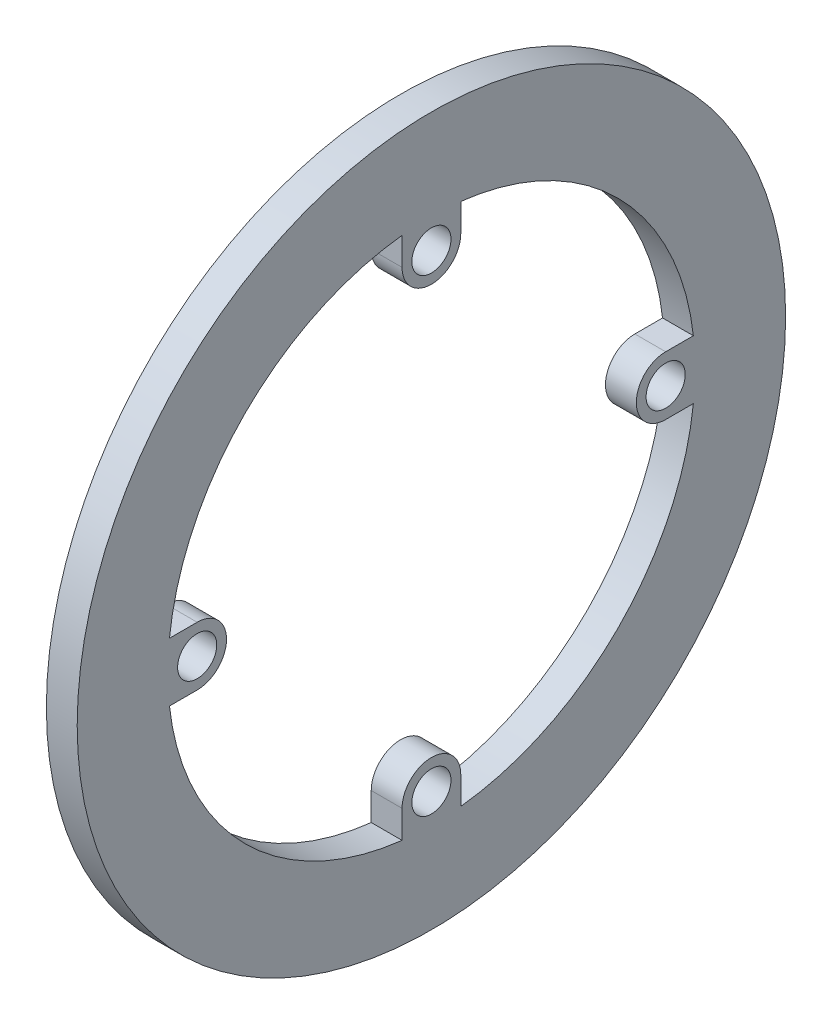
ISO-10303-21;
HEADER;
FILE_DESCRIPTION(('STEP AP214'),'2;1');
FILE_NAME('part.step','',(''),(''),'','','');
FILE_SCHEMA(('AUTOMOTIVE_DESIGN { 1 0 10303 214 1 1 1 1 }'));
ENDSEC;
DATA;
#1=APPLICATION_CONTEXT('core data for automotive mechanical design processes');
#2=APPLICATION_PROTOCOL_DEFINITION('international standard','automotive_design',2000,#1);
#3=PRODUCT_CONTEXT('',#1,'mechanical');
#4=PRODUCT('Part','Part','',(#3));
#5=PRODUCT_RELATED_PRODUCT_CATEGORY('part','',(#4));
#6=PRODUCT_DEFINITION_FORMATION('','',#4);
#7=PRODUCT_DEFINITION_CONTEXT('part definition',#1,'design');
#8=PRODUCT_DEFINITION('design','',#6,#7);
#9=PRODUCT_DEFINITION_SHAPE('','',#8);
#10=(LENGTH_UNIT() NAMED_UNIT(*) SI_UNIT(.MILLI.,.METRE.));
#11=(NAMED_UNIT(*) PLANE_ANGLE_UNIT() SI_UNIT($,.RADIAN.));
#12=(NAMED_UNIT(*) SI_UNIT($,.STERADIAN.) SOLID_ANGLE_UNIT());
#13=UNCERTAINTY_MEASURE_WITH_UNIT(LENGTH_MEASURE(1.E-05),#10,'distance_accuracy_value','');
#14=(GEOMETRIC_REPRESENTATION_CONTEXT(3) GLOBAL_UNCERTAINTY_ASSIGNED_CONTEXT((#13)) GLOBAL_UNIT_ASSIGNED_CONTEXT((#10,
#11,#12)) REPRESENTATION_CONTEXT('',''));
#15=CARTESIAN_POINT('',(0.,0.,0.));
#16=DIRECTION('',(0.,0.,1.));
#17=DIRECTION('',(1.,0.,0.));
#18=AXIS2_PLACEMENT_3D('',#15,#16,#17);
#19=CARTESIAN_POINT('',(2.5,0.,0.));
#20=DIRECTION('',(-1.,0.,0.));
#21=DIRECTION('',(0.,0.,1.));
#22=AXIS2_PLACEMENT_3D('',#19,#20,#21);
#23=CYLINDRICAL_SURFACE('',#22,42.7625);
#24=CARTESIAN_POINT('',(-2.5,0.,0.));
#25=DIRECTION('',(1.,0.,0.));
#26=DIRECTION('',(0.,0.,-1.));
#27=AXIS2_PLACEMENT_3D('',#24,#25,#26);
#28=CIRCLE('',#27,42.7625);
#29=CARTESIAN_POINT('',(-2.5,4.7625,-42.4964704416732));
#30=VERTEX_POINT('',#29);
#31=CARTESIAN_POINT('',(-2.5,42.4964704416732,-4.7625));
#32=VERTEX_POINT('',#31);
#33=EDGE_CURVE('E194',#30,#32,#28,.T.);
#34=ORIENTED_EDGE('',*,*,#33,.F.);
#35=DIRECTION('',(-1.,0.,0.));
#36=VECTOR('',#35,1.);
#37=CARTESIAN_POINT('',(2.5,4.7625,-42.4964704416732));
#38=LINE('',#37,#36);
#39=CARTESIAN_POINT('',(2.5,4.7625,-42.4964704416732));
#40=VERTEX_POINT('',#39);
#41=EDGE_CURVE('E11',#40,#30,#38,.T.);
#42=ORIENTED_EDGE('',*,*,#41,.F.);
#43=CARTESIAN_POINT('',(2.5,0.,0.));
#44=DIRECTION('',(1.,0.,0.));
#45=DIRECTION('',(0.,0.,-1.));
#46=AXIS2_PLACEMENT_3D('',#43,#44,#45);
#47=CIRCLE('',#46,42.7625);
#48=CARTESIAN_POINT('',(2.5,42.4964704416732,-4.7625));
#49=VERTEX_POINT('',#48);
#50=EDGE_CURVE('E246',#40,#49,#47,.T.);
#51=ORIENTED_EDGE('',*,*,#50,.T.);
#52=DIRECTION('',(-1.,0.,0.));
#53=VECTOR('',#52,1.);
#54=CARTESIAN_POINT('',(2.5,42.4964704416732,-4.7625));
#55=LINE('',#54,#53);
#56=EDGE_CURVE('E52',#49,#32,#55,.T.);
#57=ORIENTED_EDGE('',*,*,#56,.T.);
#58=EDGE_LOOP('',(#34,#42,#51,#57));
#59=FACE_BOUND('',#58,.T.);
#60=ADVANCED_FACE('F35',(#59),#23,.F.);
#61=CARTESIAN_POINT('',(2.5,4.7625,0.));
#62=DIRECTION('',(0.,-1.,0.));
#63=DIRECTION('',(0.,0.,-1.));
#64=AXIS2_PLACEMENT_3D('',#61,#62,#63);
#65=PLANE('',#64);
#66=DIRECTION('',(0.,0.,1.));
#67=VECTOR('',#66,1.);
#68=CARTESIAN_POINT('',(-2.5,4.7625,0.));
#69=LINE('',#68,#67);
#70=CARTESIAN_POINT('',(-2.5,4.7625,-38.));
#71=VERTEX_POINT('',#70);
#72=EDGE_CURVE('E196',#30,#71,#69,.T.);
#73=ORIENTED_EDGE('',*,*,#72,.T.);
#74=DIRECTION('',(-1.,0.,0.));
#75=VECTOR('',#74,1.);
#76=CARTESIAN_POINT('',(2.5,4.7625,-38.));
#77=LINE('',#76,#75);
#78=CARTESIAN_POINT('',(2.5,4.7625,-38.));
#79=VERTEX_POINT('',#78);
#80=EDGE_CURVE('E44',#79,#71,#77,.T.);
#81=ORIENTED_EDGE('',*,*,#80,.F.);
#82=DIRECTION('',(0.,0.,1.));
#83=VECTOR('',#82,1.);
#84=CARTESIAN_POINT('',(2.5,4.7625,0.));
#85=LINE('',#84,#83);
#86=EDGE_CURVE('E298',#40,#79,#85,.T.);
#87=ORIENTED_EDGE('',*,*,#86,.F.);
#88=ORIENTED_EDGE('',*,*,#41,.T.);
#89=EDGE_LOOP('',(#73,#81,#87,#88));
#90=FACE_BOUND('',#89,.T.);
#91=ADVANCED_FACE('F37',(#90),#65,.F.);
#92=CARTESIAN_POINT('',(2.5,0.,-38.));
#93=DIRECTION('',(-1.,0.,0.));
#94=DIRECTION('',(0.,0.,1.));
#95=AXIS2_PLACEMENT_3D('',#92,#93,#94);
#96=CYLINDRICAL_SURFACE('',#95,4.7625);
#97=CARTESIAN_POINT('',(-2.5,0.,-38.));
#98=DIRECTION('',(1.,0.,0.));
#99=DIRECTION('',(0.,0.,-1.));
#100=AXIS2_PLACEMENT_3D('',#97,#98,#99);
#101=CIRCLE('',#100,4.7625);
#102=CARTESIAN_POINT('',(-2.5,-4.76250000000001,-38.));
#103=VERTEX_POINT('',#102);
#104=EDGE_CURVE('E200',#71,#103,#101,.T.);
#105=ORIENTED_EDGE('',*,*,#104,.T.);
#106=DIRECTION('',(-1.,0.,0.));
#107=VECTOR('',#106,1.);
#108=CARTESIAN_POINT('',(2.5,-4.76250000000001,-38.));
#109=LINE('',#108,#107);
#110=CARTESIAN_POINT('',(2.5,-4.76250000000001,-38.));
#111=VERTEX_POINT('',#110);
#112=EDGE_CURVE('E268',#111,#103,#109,.T.);
#113=ORIENTED_EDGE('',*,*,#112,.F.);
#114=CARTESIAN_POINT('',(2.5,0.,-38.));
#115=DIRECTION('',(1.,0.,0.));
#116=DIRECTION('',(0.,0.,-1.));
#117=AXIS2_PLACEMENT_3D('',#114,#115,#116);
#118=CIRCLE('',#117,4.7625);
#119=EDGE_CURVE('E276',#79,#111,#118,.T.);
#120=ORIENTED_EDGE('',*,*,#119,.F.);
#121=ORIENTED_EDGE('',*,*,#80,.T.);
#122=EDGE_LOOP('',(#105,#113,#120,#121));
#123=FACE_BOUND('',#122,.T.);
#124=ADVANCED_FACE('F274',(#123),#96,.T.);
#125=CARTESIAN_POINT('',(2.5,-4.76250000000001,0.));
#126=DIRECTION('',(0.,-1.,0.));
#127=DIRECTION('',(0.,0.,-1.));
#128=AXIS2_PLACEMENT_3D('',#125,#126,#127);
#129=PLANE('',#128);
#130=DIRECTION('',(0.,0.,1.));
#131=VECTOR('',#130,1.);
#132=CARTESIAN_POINT('',(-2.5,-4.76250000000001,0.));
#133=LINE('',#132,#131);
#134=CARTESIAN_POINT('',(-2.5,-4.76250000000001,-42.4964704416732));
#135=VERTEX_POINT('',#134);
#136=EDGE_CURVE('E203',#135,#103,#133,.T.);
#137=ORIENTED_EDGE('',*,*,#136,.F.);
#138=DIRECTION('',(-1.,0.,0.));
#139=VECTOR('',#138,1.);
#140=CARTESIAN_POINT('',(2.5,-4.76250000000001,-42.4964704416732));
#141=LINE('',#140,#139);
#142=CARTESIAN_POINT('',(2.5,-4.76250000000001,-42.4964704416732));
#143=VERTEX_POINT('',#142);
#144=EDGE_CURVE('E266',#143,#135,#141,.T.);
#145=ORIENTED_EDGE('',*,*,#144,.F.);
#146=DIRECTION('',(0.,0.,1.));
#147=VECTOR('',#146,1.);
#148=CARTESIAN_POINT('',(2.5,-4.76250000000001,0.));
#149=LINE('',#148,#147);
#150=EDGE_CURVE('E290',#143,#111,#149,.T.);
#151=ORIENTED_EDGE('',*,*,#150,.T.);
#152=ORIENTED_EDGE('',*,*,#112,.T.);
#153=EDGE_LOOP('',(#137,#145,#151,#152));
#154=FACE_BOUND('',#153,.T.);
#155=ADVANCED_FACE('F287',(#154),#129,.T.);
#156=CARTESIAN_POINT('',(-2.5,-42.4964704416732,-4.7625));
#157=VERTEX_POINT('',#156);
#158=EDGE_CURVE('E198',#157,#135,#28,.T.);
#159=ORIENTED_EDGE('',*,*,#158,.F.);
#160=DIRECTION('',(-1.,0.,0.));
#161=VECTOR('',#160,1.);
#162=CARTESIAN_POINT('',(2.5,-42.4964704416732,-4.7625));
#163=LINE('',#162,#161);
#164=CARTESIAN_POINT('',(2.5,-42.4964704416732,-4.7625));
#165=VERTEX_POINT('',#164);
#166=EDGE_CURVE('E264',#165,#157,#163,.T.);
#167=ORIENTED_EDGE('',*,*,#166,.F.);
#168=EDGE_CURVE('E293',#165,#143,#47,.T.);
#169=ORIENTED_EDGE('',*,*,#168,.T.);
#170=ORIENTED_EDGE('',*,*,#144,.T.);
#171=EDGE_LOOP('',(#159,#167,#169,#170));
#172=FACE_BOUND('',#171,.T.);
#173=ADVANCED_FACE('F324',(#172),#23,.F.);
#174=CARTESIAN_POINT('',(2.5,0.,-4.7625));
#175=DIRECTION('',(0.,0.,1.));
#176=DIRECTION('',(1.,0.,0.));
#177=AXIS2_PLACEMENT_3D('',#174,#175,#176);
#178=PLANE('',#177);
#179=DIRECTION('',(0.,1.,0.));
#180=VECTOR('',#179,1.);
#181=CARTESIAN_POINT('',(-2.5,0.,-4.7625));
#182=LINE('',#181,#180);
#183=CARTESIAN_POINT('',(-2.5,-38.,-4.7625));
#184=VERTEX_POINT('',#183);
#185=EDGE_CURVE('E206',#157,#184,#182,.T.);
#186=ORIENTED_EDGE('',*,*,#185,.T.);
#187=DIRECTION('',(-1.,0.,0.));
#188=VECTOR('',#187,1.);
#189=CARTESIAN_POINT('',(2.5,-38.,-4.7625));
#190=LINE('',#189,#188);
#191=CARTESIAN_POINT('',(2.5,-38.,-4.7625));
#192=VERTEX_POINT('',#191);
#193=EDGE_CURVE('E262',#192,#184,#190,.T.);
#194=ORIENTED_EDGE('',*,*,#193,.F.);
#195=DIRECTION('',(0.,1.,0.));
#196=VECTOR('',#195,1.);
#197=CARTESIAN_POINT('',(2.5,0.,-4.7625));
#198=LINE('',#197,#196);
#199=EDGE_CURVE('E295',#165,#192,#198,.T.);
#200=ORIENTED_EDGE('',*,*,#199,.F.);
#201=ORIENTED_EDGE('',*,*,#166,.T.);
#202=EDGE_LOOP('',(#186,#194,#200,#201));
#203=FACE_BOUND('',#202,.T.);
#204=ADVANCED_FACE('F331',(#203),#178,.F.);
#205=CARTESIAN_POINT('',(2.5,-38.,0.));
#206=DIRECTION('',(-1.,0.,0.));
#207=DIRECTION('',(0.,0.,1.));
#208=AXIS2_PLACEMENT_3D('',#205,#206,#207);
#209=CYLINDRICAL_SURFACE('',#208,4.76249999999999);
#210=CARTESIAN_POINT('',(-2.5,-38.,0.));
#211=DIRECTION('',(1.,0.,0.));
#212=DIRECTION('',(0.,0.,-1.));
#213=AXIS2_PLACEMENT_3D('',#210,#211,#212);
#214=CIRCLE('',#213,4.76249999999999);
#215=CARTESIAN_POINT('',(-2.5,-38.,4.76249999999999));
#216=VERTEX_POINT('',#215);
#217=EDGE_CURVE('E209',#216,#184,#214,.F.);
#218=ORIENTED_EDGE('',*,*,#217,.F.);
#219=DIRECTION('',(-1.,0.,0.));
#220=VECTOR('',#219,1.);
#221=CARTESIAN_POINT('',(2.5,-38.,4.76249999999999));
#222=LINE('',#221,#220);
#223=CARTESIAN_POINT('',(2.5,-38.,4.76249999999999));
#224=VERTEX_POINT('',#223);
#225=EDGE_CURVE('E260',#224,#216,#222,.T.);
#226=ORIENTED_EDGE('',*,*,#225,.F.);
#227=CARTESIAN_POINT('',(2.5,-38.,0.));
#228=DIRECTION('',(1.,0.,0.));
#229=DIRECTION('',(0.,0.,-1.));
#230=AXIS2_PLACEMENT_3D('',#227,#228,#229);
#231=CIRCLE('',#230,4.76249999999999);
#232=EDGE_CURVE('E303',#224,#192,#231,.F.);
#233=ORIENTED_EDGE('',*,*,#232,.T.);
#234=ORIENTED_EDGE('',*,*,#193,.T.);
#235=EDGE_LOOP('',(#218,#226,#233,#234));
#236=FACE_BOUND('',#235,.T.);
#237=ADVANCED_FACE('F352',(#236),#209,.T.);
#238=CARTESIAN_POINT('',(2.5,0.,4.76249999999998));
#239=DIRECTION('',(0.,0.,1.));
#240=DIRECTION('',(0.,-1.,0.));
#241=AXIS2_PLACEMENT_3D('',#238,#239,#240);
#242=PLANE('',#241);
#243=DIRECTION('',(0.,1.,0.));
#244=VECTOR('',#243,1.);
#245=CARTESIAN_POINT('',(-2.5,0.,4.76249999999998));
#246=LINE('',#245,#244);
#247=CARTESIAN_POINT('',(-2.5,-42.4964704416732,4.76249999999999));
#248=VERTEX_POINT('',#247);
#249=EDGE_CURVE('E212',#248,#216,#246,.T.);
#250=ORIENTED_EDGE('',*,*,#249,.F.);
#251=DIRECTION('',(-1.,0.,0.));
#252=VECTOR('',#251,1.);
#253=CARTESIAN_POINT('',(2.5,-42.4964704416732,4.76249999999999));
#254=LINE('',#253,#252);
#255=CARTESIAN_POINT('',(2.5,-42.4964704416732,4.76249999999999));
#256=VERTEX_POINT('',#255);
#257=EDGE_CURVE('E258',#256,#248,#254,.T.);
#258=ORIENTED_EDGE('',*,*,#257,.F.);
#259=DIRECTION('',(0.,1.,0.));
#260=VECTOR('',#259,1.);
#261=CARTESIAN_POINT('',(2.5,0.,4.76249999999998));
#262=LINE('',#261,#260);
#263=EDGE_CURVE('E306',#256,#224,#262,.T.);
#264=ORIENTED_EDGE('',*,*,#263,.T.);
#265=ORIENTED_EDGE('',*,*,#225,.T.);
#266=EDGE_LOOP('',(#250,#258,#264,#265));
#267=FACE_BOUND('',#266,.T.);
#268=ADVANCED_FACE('F344',(#267),#242,.T.);
#269=CARTESIAN_POINT('',(-2.5,-4.76250000000001,42.4964704416732));
#270=VERTEX_POINT('',#269);
#271=EDGE_CURVE('E215',#270,#248,#28,.T.);
#272=ORIENTED_EDGE('',*,*,#271,.F.);
#273=DIRECTION('',(-1.,0.,0.));
#274=VECTOR('',#273,1.);
#275=CARTESIAN_POINT('',(2.5,-4.76250000000001,42.4964704416732));
#276=LINE('',#275,#274);
#277=CARTESIAN_POINT('',(2.5,-4.76250000000001,42.4964704416732));
#278=VERTEX_POINT('',#277);
#279=EDGE_CURVE('E256',#278,#270,#276,.T.);
#280=ORIENTED_EDGE('',*,*,#279,.F.);
#281=EDGE_CURVE('E297',#278,#256,#47,.T.);
#282=ORIENTED_EDGE('',*,*,#281,.T.);
#283=ORIENTED_EDGE('',*,*,#257,.T.);
#284=EDGE_LOOP('',(#272,#280,#282,#283));
#285=FACE_BOUND('',#284,.T.);
#286=ADVANCED_FACE('F333',(#285),#23,.F.);
#287=CARTESIAN_POINT('',(2.5,-4.76250000000001,0.));
#288=DIRECTION('',(0.,1.,0.));
#289=DIRECTION('',(0.,0.,1.));
#290=AXIS2_PLACEMENT_3D('',#287,#288,#289);
#291=PLANE('',#290);
#292=DIRECTION('',(0.,0.,-1.));
#293=VECTOR('',#292,1.);
#294=CARTESIAN_POINT('',(-2.5,-4.76250000000001,0.));
#295=LINE('',#294,#293);
#296=CARTESIAN_POINT('',(-2.5,-4.76250000000001,38.));
#297=VERTEX_POINT('',#296);
#298=EDGE_CURVE('E216',#270,#297,#295,.T.);
#299=ORIENTED_EDGE('',*,*,#298,.T.);
#300=DIRECTION('',(-1.,0.,0.));
#301=VECTOR('',#300,1.);
#302=CARTESIAN_POINT('',(2.5,-4.76250000000001,38.));
#303=LINE('',#302,#301);
#304=CARTESIAN_POINT('',(2.5,-4.76250000000001,38.));
#305=VERTEX_POINT('',#304);
#306=EDGE_CURVE('E254',#305,#297,#303,.T.);
#307=ORIENTED_EDGE('',*,*,#306,.F.);
#308=DIRECTION('',(0.,0.,-1.));
#309=VECTOR('',#308,1.);
#310=CARTESIAN_POINT('',(2.5,-4.76250000000001,0.));
#311=LINE('',#310,#309);
#312=EDGE_CURVE('E309',#278,#305,#311,.T.);
#313=ORIENTED_EDGE('',*,*,#312,.F.);
#314=ORIENTED_EDGE('',*,*,#279,.T.);
#315=EDGE_LOOP('',(#299,#307,#313,#314));
#316=FACE_BOUND('',#315,.T.);
#317=ADVANCED_FACE('F343',(#316),#291,.F.);
#318=CARTESIAN_POINT('',(2.5,0.,38.));
#319=DIRECTION('',(-1.,0.,0.));
#320=DIRECTION('',(0.,0.,1.));
#321=AXIS2_PLACEMENT_3D('',#318,#319,#320);
#322=CYLINDRICAL_SURFACE('',#321,4.7625);
#323=CARTESIAN_POINT('',(-2.5,0.,38.));
#324=DIRECTION('',(1.,0.,0.));
#325=DIRECTION('',(0.,0.,-1.));
#326=AXIS2_PLACEMENT_3D('',#323,#324,#325);
#327=CIRCLE('',#326,4.7625);
#328=CARTESIAN_POINT('',(-2.5,4.7625,38.));
#329=VERTEX_POINT('',#328);
#330=EDGE_CURVE('E219',#329,#297,#327,.F.);
#331=ORIENTED_EDGE('',*,*,#330,.F.);
#332=DIRECTION('',(-1.,0.,0.));
#333=VECTOR('',#332,1.);
#334=CARTESIAN_POINT('',(2.5,4.7625,38.));
#335=LINE('',#334,#333);
#336=CARTESIAN_POINT('',(2.5,4.7625,38.));
#337=VERTEX_POINT('',#336);
#338=EDGE_CURVE('E252',#337,#329,#335,.T.);
#339=ORIENTED_EDGE('',*,*,#338,.F.);
#340=CARTESIAN_POINT('',(2.5,0.,38.));
#341=DIRECTION('',(1.,0.,0.));
#342=DIRECTION('',(0.,0.,-1.));
#343=AXIS2_PLACEMENT_3D('',#340,#341,#342);
#344=CIRCLE('',#343,4.7625);
#345=EDGE_CURVE('E311',#337,#305,#344,.F.);
#346=ORIENTED_EDGE('',*,*,#345,.T.);
#347=ORIENTED_EDGE('',*,*,#306,.T.);
#348=EDGE_LOOP('',(#331,#339,#346,#347));
#349=FACE_BOUND('',#348,.T.);
#350=ADVANCED_FACE('F340',(#349),#322,.T.);
#351=CARTESIAN_POINT('',(2.5,4.7625,0.));
#352=DIRECTION('',(0.,1.,0.));
#353=DIRECTION('',(0.,0.,1.));
#354=AXIS2_PLACEMENT_3D('',#351,#352,#353);
#355=PLANE('',#354);
#356=DIRECTION('',(0.,0.,-1.));
#357=VECTOR('',#356,1.);
#358=CARTESIAN_POINT('',(-2.5,4.7625,0.));
#359=LINE('',#358,#357);
#360=CARTESIAN_POINT('',(-2.5,4.7625,42.4964704416732));
#361=VERTEX_POINT('',#360);
#362=EDGE_CURVE('E222',#361,#329,#359,.T.);
#363=ORIENTED_EDGE('',*,*,#362,.F.);
#364=DIRECTION('',(-1.,0.,0.));
#365=VECTOR('',#364,1.);
#366=CARTESIAN_POINT('',(2.5,4.7625,42.4964704416732));
#367=LINE('',#366,#365);
#368=CARTESIAN_POINT('',(2.5,4.7625,42.4964704416732));
#369=VERTEX_POINT('',#368);
#370=EDGE_CURVE('E250',#369,#361,#367,.T.);
#371=ORIENTED_EDGE('',*,*,#370,.F.);
#372=DIRECTION('',(0.,0.,-1.));
#373=VECTOR('',#372,1.);
#374=CARTESIAN_POINT('',(2.5,4.7625,0.));
#375=LINE('',#374,#373);
#376=EDGE_CURVE('E313',#369,#337,#375,.T.);
#377=ORIENTED_EDGE('',*,*,#376,.T.);
#378=ORIENTED_EDGE('',*,*,#338,.T.);
#379=EDGE_LOOP('',(#363,#371,#377,#378));
#380=FACE_BOUND('',#379,.T.);
#381=ADVANCED_FACE('F335',(#380),#355,.T.);
#382=CARTESIAN_POINT('',(-2.5,42.4964704416732,4.76249999999999));
#383=VERTEX_POINT('',#382);
#384=EDGE_CURVE('E197',#383,#361,#28,.T.);
#385=ORIENTED_EDGE('',*,*,#384,.F.);
#386=DIRECTION('',(-1.,0.,0.));
#387=VECTOR('',#386,1.);
#388=CARTESIAN_POINT('',(2.5,42.4964704416732,4.76249999999999));
#389=LINE('',#388,#387);
#390=CARTESIAN_POINT('',(2.5,42.4964704416732,4.76249999999999));
#391=VERTEX_POINT('',#390);
#392=EDGE_CURVE('E171',#391,#383,#389,.T.);
#393=ORIENTED_EDGE('',*,*,#392,.F.);
#394=EDGE_CURVE('E161',#391,#369,#47,.T.);
#395=ORIENTED_EDGE('',*,*,#394,.T.);
#396=ORIENTED_EDGE('',*,*,#370,.T.);
#397=EDGE_LOOP('',(#385,#393,#395,#396));
#398=FACE_BOUND('',#397,.T.);
#399=ADVANCED_FACE('F325',(#398),#23,.F.);
#400=CARTESIAN_POINT('',(2.5,0.,4.76249999999998));
#401=DIRECTION('',(0.,0.,-1.));
#402=DIRECTION('',(0.,1.,0.));
#403=AXIS2_PLACEMENT_3D('',#400,#401,#402);
#404=PLANE('',#403);
#405=DIRECTION('',(0.,-1.,0.));
#406=VECTOR('',#405,1.);
#407=CARTESIAN_POINT('',(-2.5,0.,4.76249999999998));
#408=LINE('',#407,#406);
#409=CARTESIAN_POINT('',(-2.5,38.,4.76249999999999));
#410=VERTEX_POINT('',#409);
#411=EDGE_CURVE('E168',#383,#410,#408,.T.);
#412=ORIENTED_EDGE('',*,*,#411,.T.);
#413=DIRECTION('',(-1.,0.,0.));
#414=VECTOR('',#413,1.);
#415=CARTESIAN_POINT('',(2.5,38.,4.76249999999999));
#416=LINE('',#415,#414);
#417=CARTESIAN_POINT('',(2.5,38.,4.76249999999999));
#418=VERTEX_POINT('',#417);
#419=EDGE_CURVE('E165',#418,#410,#416,.T.);
#420=ORIENTED_EDGE('',*,*,#419,.F.);
#421=DIRECTION('',(0.,-1.,0.));
#422=VECTOR('',#421,1.);
#423=CARTESIAN_POINT('',(2.5,0.,4.76249999999998));
#424=LINE('',#423,#422);
#425=EDGE_CURVE('E151',#391,#418,#424,.T.);
#426=ORIENTED_EDGE('',*,*,#425,.F.);
#427=ORIENTED_EDGE('',*,*,#392,.T.);
#428=EDGE_LOOP('',(#412,#420,#426,#427));
#429=FACE_BOUND('',#428,.T.);
#430=ADVANCED_FACE('F166',(#429),#404,.F.);
#431=CARTESIAN_POINT('',(2.5,38.,0.));
#432=DIRECTION('',(-1.,0.,0.));
#433=DIRECTION('',(0.,0.,1.));
#434=AXIS2_PLACEMENT_3D('',#431,#432,#433);
#435=CYLINDRICAL_SURFACE('',#434,4.76249999999999);
#436=CARTESIAN_POINT('',(-2.5,38.,0.));
#437=DIRECTION('',(1.,0.,0.));
#438=DIRECTION('',(0.,0.,-1.));
#439=AXIS2_PLACEMENT_3D('',#436,#437,#438);
#440=CIRCLE('',#439,4.76249999999999);
#441=CARTESIAN_POINT('',(-2.5,38.,-4.7625));
#442=VERTEX_POINT('',#441);
#443=EDGE_CURVE('E226',#410,#442,#440,.T.);
#444=ORIENTED_EDGE('',*,*,#443,.T.);
#445=DIRECTION('',(-1.,0.,0.));
#446=VECTOR('',#445,1.);
#447=CARTESIAN_POINT('',(2.5,38.,-4.7625));
#448=LINE('',#447,#446);
#449=CARTESIAN_POINT('',(2.5,38.,-4.7625));
#450=VERTEX_POINT('',#449);
#451=EDGE_CURVE('E102',#450,#442,#448,.T.);
#452=ORIENTED_EDGE('',*,*,#451,.F.);
#453=CARTESIAN_POINT('',(2.5,38.,0.));
#454=DIRECTION('',(1.,0.,0.));
#455=DIRECTION('',(0.,0.,-1.));
#456=AXIS2_PLACEMENT_3D('',#453,#454,#455);
#457=CIRCLE('',#456,4.76249999999999);
#458=EDGE_CURVE('E158',#418,#450,#457,.T.);
#459=ORIENTED_EDGE('',*,*,#458,.F.);
#460=ORIENTED_EDGE('',*,*,#419,.T.);
#461=EDGE_LOOP('',(#444,#452,#459,#460));
#462=FACE_BOUND('',#461,.T.);
#463=ADVANCED_FACE('F173',(#462),#435,.T.);
#464=CARTESIAN_POINT('',(2.5,0.,38.));
#465=DIRECTION('',(-1.,0.,0.));
#466=DIRECTION('',(0.,0.,1.));
#467=AXIS2_PLACEMENT_3D('',#464,#465,#466);
#468=CYLINDRICAL_SURFACE('',#467,3.175);
#469=CARTESIAN_POINT('',(2.5,0.,38.));
#470=DIRECTION('',(1.,0.,0.));
#471=DIRECTION('',(0.,0.,-1.));
#472=AXIS2_PLACEMENT_3D('',#469,#470,#471);
#473=CIRCLE('',#472,3.175);
#474=CARTESIAN_POINT('',(2.5,0.,34.825));
#475=VERTEX_POINT('',#474);
#476=EDGE_CURVE('E188',#475,#475,#473,.T.);
#477=ORIENTED_EDGE('',*,*,#476,.T.);
#478=EDGE_LOOP('',(#477));
#479=FACE_BOUND('',#478,.T.);
#480=CARTESIAN_POINT('',(-2.5,0.,38.));
#481=DIRECTION('',(1.,0.,0.));
#482=DIRECTION('',(0.,0.,-1.));
#483=AXIS2_PLACEMENT_3D('',#480,#481,#482);
#484=CIRCLE('',#483,3.175);
#485=CARTESIAN_POINT('',(-2.5,0.,34.825));
#486=VERTEX_POINT('',#485);
#487=EDGE_CURVE('E240',#486,#486,#484,.T.);
#488=ORIENTED_EDGE('',*,*,#487,.F.);
#489=EDGE_LOOP('',(#488));
#490=FACE_BOUND('',#489,.T.);
#491=ADVANCED_FACE('F449',(#479,#490),#468,.F.);
#492=CARTESIAN_POINT('',(2.5,-38.,0.));
#493=DIRECTION('',(-1.,0.,0.));
#494=DIRECTION('',(0.,0.,1.));
#495=AXIS2_PLACEMENT_3D('',#492,#493,#494);
#496=CYLINDRICAL_SURFACE('',#495,3.175);
#497=CARTESIAN_POINT('',(2.5,-38.,0.));
#498=DIRECTION('',(1.,0.,0.));
#499=DIRECTION('',(0.,0.,-1.));
#500=AXIS2_PLACEMENT_3D('',#497,#498,#499);
#501=CIRCLE('',#500,3.175);
#502=CARTESIAN_POINT('',(2.5,-38.,-3.175));
#503=VERTEX_POINT('',#502);
#504=EDGE_CURVE('E185',#503,#503,#501,.T.);
#505=ORIENTED_EDGE('',*,*,#504,.T.);
#506=EDGE_LOOP('',(#505));
#507=FACE_BOUND('',#506,.T.);
#508=CARTESIAN_POINT('',(-2.5,-38.,0.));
#509=DIRECTION('',(1.,0.,0.));
#510=DIRECTION('',(0.,0.,-1.));
#511=AXIS2_PLACEMENT_3D('',#508,#509,#510);
#512=CIRCLE('',#511,3.175);
#513=CARTESIAN_POINT('',(-2.5,-38.,-3.175));
#514=VERTEX_POINT('',#513);
#515=EDGE_CURVE('E237',#514,#514,#512,.T.);
#516=ORIENTED_EDGE('',*,*,#515,.F.);
#517=EDGE_LOOP('',(#516));
#518=FACE_BOUND('',#517,.T.);
#519=ADVANCED_FACE('F458',(#507,#518),#496,.F.);
#520=CARTESIAN_POINT('',(2.5,0.,-38.));
#521=DIRECTION('',(-1.,0.,0.));
#522=DIRECTION('',(0.,0.,1.));
#523=AXIS2_PLACEMENT_3D('',#520,#521,#522);
#524=CYLINDRICAL_SURFACE('',#523,3.175);
#525=CARTESIAN_POINT('',(2.5,0.,-38.));
#526=DIRECTION('',(1.,0.,0.));
#527=DIRECTION('',(0.,0.,-1.));
#528=AXIS2_PLACEMENT_3D('',#525,#526,#527);
#529=CIRCLE('',#528,3.175);
#530=CARTESIAN_POINT('',(2.5,0.,-41.175));
#531=VERTEX_POINT('',#530);
#532=EDGE_CURVE('E182',#531,#531,#529,.T.);
#533=ORIENTED_EDGE('',*,*,#532,.T.);
#534=EDGE_LOOP('',(#533));
#535=FACE_BOUND('',#534,.T.);
#536=CARTESIAN_POINT('',(-2.5,0.,-38.));
#537=DIRECTION('',(1.,0.,0.));
#538=DIRECTION('',(0.,0.,-1.));
#539=AXIS2_PLACEMENT_3D('',#536,#537,#538);
#540=CIRCLE('',#539,3.175);
#541=CARTESIAN_POINT('',(-2.5,0.,-41.175));
#542=VERTEX_POINT('',#541);
#543=EDGE_CURVE('E234',#542,#542,#540,.T.);
#544=ORIENTED_EDGE('',*,*,#543,.F.);
#545=EDGE_LOOP('',(#544));
#546=FACE_BOUND('',#545,.T.);
#547=ADVANCED_FACE('F468',(#535,#546),#524,.F.);
#548=CARTESIAN_POINT('',(2.5,0.,0.));
#549=DIRECTION('',(-1.,0.,0.));
#550=DIRECTION('',(0.,0.,1.));
#551=AXIS2_PLACEMENT_3D('',#548,#549,#550);
#552=CYLINDRICAL_SURFACE('',#551,57.4630333180121);
#553=CARTESIAN_POINT('',(2.5,0.,0.));
#554=DIRECTION('',(1.,0.,0.));
#555=DIRECTION('',(0.,0.,-1.));
#556=AXIS2_PLACEMENT_3D('',#553,#554,#555);
#557=CIRCLE('',#556,57.4630333180121);
#558=CARTESIAN_POINT('',(2.5,0.,-57.4630333180121));
#559=VERTEX_POINT('',#558);
#560=EDGE_CURVE('E176',#559,#559,#557,.T.);
#561=ORIENTED_EDGE('',*,*,#560,.F.);
#562=EDGE_LOOP('',(#561));
#563=FACE_BOUND('',#562,.T.);
#564=CARTESIAN_POINT('',(-2.5,0.,0.));
#565=DIRECTION('',(1.,0.,0.));
#566=DIRECTION('',(0.,0.,-1.));
#567=AXIS2_PLACEMENT_3D('',#564,#565,#566);
#568=CIRCLE('',#567,57.4630333180121);
#569=CARTESIAN_POINT('',(-2.5,0.,-57.4630333180121));
#570=VERTEX_POINT('',#569);
#571=EDGE_CURVE('E231',#570,#570,#568,.T.);
#572=ORIENTED_EDGE('',*,*,#571,.T.);
#573=EDGE_LOOP('',(#572));
#574=FACE_BOUND('',#573,.T.);
#575=ADVANCED_FACE('F478',(#563,#574),#552,.T.);
#576=CARTESIAN_POINT('',(2.5,0.,-4.7625));
#577=DIRECTION('',(0.,0.,-1.));
#578=DIRECTION('',(-1.,0.,0.));
#579=AXIS2_PLACEMENT_3D('',#576,#577,#578);
#580=PLANE('',#579);
#581=DIRECTION('',(0.,-1.,0.));
#582=VECTOR('',#581,1.);
#583=CARTESIAN_POINT('',(-2.5,0.,-4.7625));
#584=LINE('',#583,#582);
#585=EDGE_CURVE('E228',#32,#442,#584,.T.);
#586=ORIENTED_EDGE('',*,*,#585,.F.);
#587=ORIENTED_EDGE('',*,*,#56,.F.);
#588=DIRECTION('',(0.,-1.,0.));
#589=VECTOR('',#588,1.);
#590=CARTESIAN_POINT('',(2.5,0.,-4.7625));
#591=LINE('',#590,#589);
#592=EDGE_CURVE('E174',#49,#450,#591,.T.);
#593=ORIENTED_EDGE('',*,*,#592,.T.);
#594=ORIENTED_EDGE('',*,*,#451,.T.);
#595=EDGE_LOOP('',(#586,#587,#593,#594));
#596=FACE_BOUND('',#595,.T.);
#597=ADVANCED_FACE('F488',(#596),#580,.T.);
#598=CARTESIAN_POINT('',(2.5,38.,0.));
#599=DIRECTION('',(-1.,0.,0.));
#600=DIRECTION('',(0.,0.,1.));
#601=AXIS2_PLACEMENT_3D('',#598,#599,#600);
#602=CYLINDRICAL_SURFACE('',#601,3.175);
#603=CARTESIAN_POINT('',(2.5,38.,0.));
#604=DIRECTION('',(1.,0.,0.));
#605=DIRECTION('',(0.,0.,-1.));
#606=AXIS2_PLACEMENT_3D('',#603,#604,#605);
#607=CIRCLE('',#606,3.175);
#608=CARTESIAN_POINT('',(2.5,38.,-3.175));
#609=VERTEX_POINT('',#608);
#610=EDGE_CURVE('E191',#609,#609,#607,.T.);
#611=ORIENTED_EDGE('',*,*,#610,.T.);
#612=EDGE_LOOP('',(#611));
#613=FACE_BOUND('',#612,.T.);
#614=CARTESIAN_POINT('',(-2.5,38.,0.));
#615=DIRECTION('',(1.,0.,0.));
#616=DIRECTION('',(0.,0.,-1.));
#617=AXIS2_PLACEMENT_3D('',#614,#615,#616);
#618=CIRCLE('',#617,3.175);
#619=CARTESIAN_POINT('',(-2.5,38.,-3.175));
#620=VERTEX_POINT('',#619);
#621=EDGE_CURVE('E243',#620,#620,#618,.T.);
#622=ORIENTED_EDGE('',*,*,#621,.F.);
#623=EDGE_LOOP('',(#622));
#624=FACE_BOUND('',#623,.T.);
#625=ADVANCED_FACE('F498',(#613,#624),#602,.F.);
#626=CARTESIAN_POINT('',(2.5,0.,0.));
#627=DIRECTION('',(1.,0.,0.));
#628=DIRECTION('',(0.,0.,-1.));
#629=AXIS2_PLACEMENT_3D('',#626,#627,#628);
#630=PLANE('',#629);
#631=ORIENTED_EDGE('',*,*,#50,.F.);
#632=ORIENTED_EDGE('',*,*,#86,.T.);
#633=ORIENTED_EDGE('',*,*,#119,.T.);
#634=ORIENTED_EDGE('',*,*,#150,.F.);
#635=ORIENTED_EDGE('',*,*,#168,.F.);
#636=ORIENTED_EDGE('',*,*,#199,.T.);
#637=ORIENTED_EDGE('',*,*,#232,.F.);
#638=ORIENTED_EDGE('',*,*,#263,.F.);
#639=ORIENTED_EDGE('',*,*,#281,.F.);
#640=ORIENTED_EDGE('',*,*,#312,.T.);
#641=ORIENTED_EDGE('',*,*,#345,.F.);
#642=ORIENTED_EDGE('',*,*,#376,.F.);
#643=ORIENTED_EDGE('',*,*,#394,.F.);
#644=ORIENTED_EDGE('',*,*,#425,.T.);
#645=ORIENTED_EDGE('',*,*,#458,.T.);
#646=ORIENTED_EDGE('',*,*,#592,.F.);
#647=EDGE_LOOP('',(#631,#632,#633,#634,#635,#636,#637,#638,#639,#640,#641,#642,#643,#644,#645,#646));
#648=FACE_BOUND('',#647,.T.);
#649=ORIENTED_EDGE('',*,*,#560,.T.);
#650=EDGE_LOOP('',(#649));
#651=FACE_BOUND('',#650,.T.);
#652=ORIENTED_EDGE('',*,*,#532,.F.);
#653=EDGE_LOOP('',(#652));
#654=FACE_BOUND('',#653,.T.);
#655=ORIENTED_EDGE('',*,*,#504,.F.);
#656=EDGE_LOOP('',(#655));
#657=FACE_BOUND('',#656,.T.);
#658=ORIENTED_EDGE('',*,*,#476,.F.);
#659=EDGE_LOOP('',(#658));
#660=FACE_BOUND('',#659,.T.);
#661=ORIENTED_EDGE('',*,*,#610,.F.);
#662=EDGE_LOOP('',(#661));
#663=FACE_BOUND('',#662,.T.);
#664=ADVANCED_FACE('F154',(#648,#651,#654,#657,#660,#663),#630,.T.);
#665=CARTESIAN_POINT('',(-2.5,0.,0.));
#666=DIRECTION('',(1.,0.,0.));
#667=DIRECTION('',(0.,0.,-1.));
#668=AXIS2_PLACEMENT_3D('',#665,#666,#667);
#669=PLANE('',#668);
#670=ORIENTED_EDGE('',*,*,#33,.T.);
#671=ORIENTED_EDGE('',*,*,#585,.T.);
#672=ORIENTED_EDGE('',*,*,#443,.F.);
#673=ORIENTED_EDGE('',*,*,#411,.F.);
#674=ORIENTED_EDGE('',*,*,#384,.T.);
#675=ORIENTED_EDGE('',*,*,#362,.T.);
#676=ORIENTED_EDGE('',*,*,#330,.T.);
#677=ORIENTED_EDGE('',*,*,#298,.F.);
#678=ORIENTED_EDGE('',*,*,#271,.T.);
#679=ORIENTED_EDGE('',*,*,#249,.T.);
#680=ORIENTED_EDGE('',*,*,#217,.T.);
#681=ORIENTED_EDGE('',*,*,#185,.F.);
#682=ORIENTED_EDGE('',*,*,#158,.T.);
#683=ORIENTED_EDGE('',*,*,#136,.T.);
#684=ORIENTED_EDGE('',*,*,#104,.F.);
#685=ORIENTED_EDGE('',*,*,#72,.F.);
#686=EDGE_LOOP('',(#670,#671,#672,#673,#674,#675,#676,#677,#678,#679,#680,#681,#682,#683,#684,#685));
#687=FACE_BOUND('',#686,.T.);
#688=ORIENTED_EDGE('',*,*,#571,.F.);
#689=EDGE_LOOP('',(#688));
#690=FACE_BOUND('',#689,.T.);
#691=ORIENTED_EDGE('',*,*,#543,.T.);
#692=EDGE_LOOP('',(#691));
#693=FACE_BOUND('',#692,.T.);
#694=ORIENTED_EDGE('',*,*,#515,.T.);
#695=EDGE_LOOP('',(#694));
#696=FACE_BOUND('',#695,.T.);
#697=ORIENTED_EDGE('',*,*,#487,.T.);
#698=EDGE_LOOP('',(#697));
#699=FACE_BOUND('',#698,.T.);
#700=ORIENTED_EDGE('',*,*,#621,.T.);
#701=EDGE_LOOP('',(#700));
#702=FACE_BOUND('',#701,.T.);
#703=ADVANCED_FACE('F280',(#687,#690,#693,#696,#699,#702),#669,.F.);
#704=CLOSED_SHELL('',(#60,#91,#124,#155,#173,#204,#237,#268,#286,#317,#350,#381,#399,#430,#463,
#491,#519,#547,#575,#597,#625,#664,#703));
#705=MANIFOLD_SOLID_BREP('B2',#704);
#706=ADVANCED_BREP_SHAPE_REPRESENTATION('',(#18,#705),#14);
#707=SHAPE_DEFINITION_REPRESENTATION(#9,#706);
ENDSEC;
END-ISO-10303-21;
